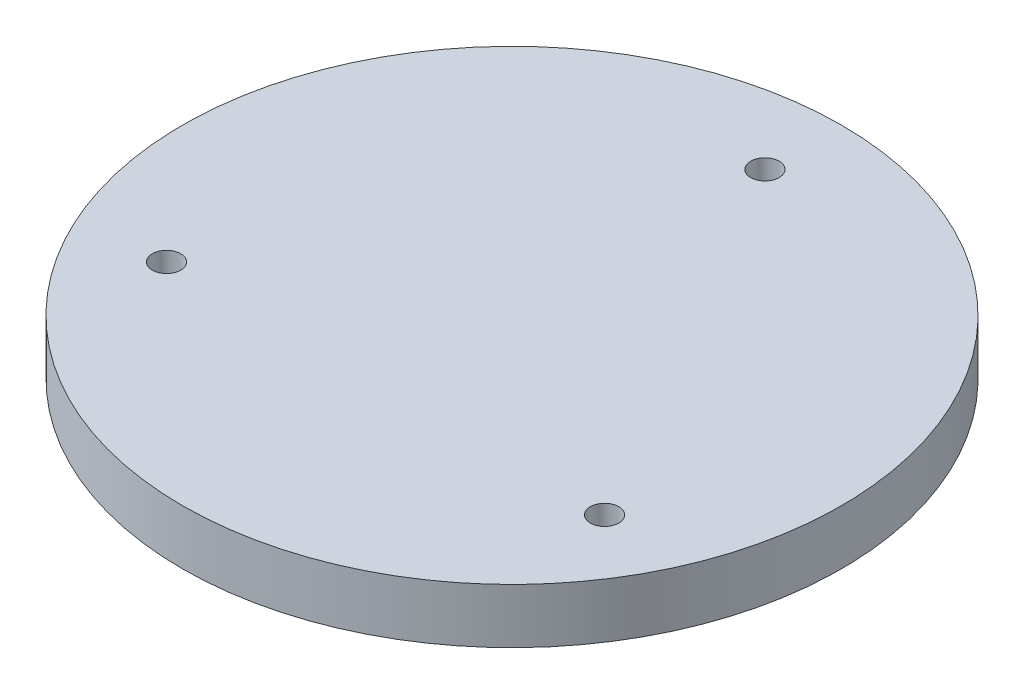
ISO-10303-21;
HEADER;
FILE_DESCRIPTION(('STEP AP214'),'2;1');
FILE_NAME('part.step','',(''),(''),'','','');
FILE_SCHEMA(('AUTOMOTIVE_DESIGN { 1 0 10303 214 1 1 1 1 }'));
ENDSEC;
DATA;
#1=APPLICATION_CONTEXT('core data for automotive mechanical design processes');
#2=APPLICATION_PROTOCOL_DEFINITION('international standard','automotive_design',2000,#1);
#3=PRODUCT_CONTEXT('',#1,'mechanical');
#4=PRODUCT('Part','Part','',(#3));
#5=PRODUCT_RELATED_PRODUCT_CATEGORY('part','',(#4));
#6=PRODUCT_DEFINITION_FORMATION('','',#4);
#7=PRODUCT_DEFINITION_CONTEXT('part definition',#1,'design');
#8=PRODUCT_DEFINITION('design','',#6,#7);
#9=PRODUCT_DEFINITION_SHAPE('','',#8);
#10=(LENGTH_UNIT() NAMED_UNIT(*) SI_UNIT(.MILLI.,.METRE.));
#11=(NAMED_UNIT(*) PLANE_ANGLE_UNIT() SI_UNIT($,.RADIAN.));
#12=(NAMED_UNIT(*) SI_UNIT($,.STERADIAN.) SOLID_ANGLE_UNIT());
#13=UNCERTAINTY_MEASURE_WITH_UNIT(LENGTH_MEASURE(1.E-05),#10,'distance_accuracy_value','');
#14=(GEOMETRIC_REPRESENTATION_CONTEXT(3) GLOBAL_UNCERTAINTY_ASSIGNED_CONTEXT((#13)) GLOBAL_UNIT_ASSIGNED_CONTEXT((#10,
#11,#12)) REPRESENTATION_CONTEXT('',''));
#15=CARTESIAN_POINT('',(0.,0.,0.));
#16=DIRECTION('',(0.,0.,1.));
#17=DIRECTION('',(1.,0.,0.));
#18=AXIS2_PLACEMENT_3D('',#15,#16,#17);
#19=CARTESIAN_POINT('',(0.,6.35,0.));
#20=DIRECTION('',(0.,-1.,0.));
#21=DIRECTION('',(0.,0.,-1.));
#22=AXIS2_PLACEMENT_3D('',#19,#20,#21);
#23=CYLINDRICAL_SURFACE('',#22,38.227);
#24=CARTESIAN_POINT('',(0.,6.35,0.));
#25=DIRECTION('',(0.,1.,0.));
#26=DIRECTION('',(0.,0.,1.));
#27=AXIS2_PLACEMENT_3D('',#24,#25,#26);
#28=CIRCLE('',#27,38.227);
#29=CARTESIAN_POINT('',(0.,6.35,38.227));
#30=VERTEX_POINT('',#29);
#31=EDGE_CURVE('E10',#30,#30,#28,.T.);
#32=ORIENTED_EDGE('',*,*,#31,.F.);
#33=EDGE_LOOP('',(#32));
#34=FACE_BOUND('',#33,.T.);
#35=CARTESIAN_POINT('',(0.,0.,0.));
#36=DIRECTION('',(0.,1.,0.));
#37=DIRECTION('',(0.,0.,1.));
#38=AXIS2_PLACEMENT_3D('',#35,#36,#37);
#39=CIRCLE('',#38,38.227);
#40=CARTESIAN_POINT('',(0.,0.,38.227));
#41=VERTEX_POINT('',#40);
#42=EDGE_CURVE('E36',#41,#41,#39,.T.);
#43=ORIENTED_EDGE('',*,*,#42,.T.);
#44=EDGE_LOOP('',(#43));
#45=FACE_BOUND('',#44,.T.);
#46=ADVANCED_FACE('F33',(#34,#45),#23,.T.);
#47=CARTESIAN_POINT('',(0.,6.35,0.));
#48=DIRECTION('',(0.,1.,0.));
#49=DIRECTION('',(0.,0.,1.));
#50=AXIS2_PLACEMENT_3D('',#47,#48,#49);
#51=PLANE('',#50);
#52=CARTESIAN_POINT('',(0.,6.35,-29.337));
#53=DIRECTION('',(0.,1.,0.));
#54=DIRECTION('',(0.,0.,1.));
#55=AXIS2_PLACEMENT_3D('',#52,#53,#54);
#56=CIRCLE('',#55,1.651);
#57=CARTESIAN_POINT('',(0.,6.35,-27.686));
#58=VERTEX_POINT('',#57);
#59=EDGE_CURVE('E57',#58,#58,#56,.T.);
#60=ORIENTED_EDGE('',*,*,#59,.F.);
#61=EDGE_LOOP('',(#60));
#62=FACE_BOUND('',#61,.T.);
#63=CARTESIAN_POINT('',(25.4065872708259,6.35,14.668499999999));
#64=DIRECTION('',(0.,1.,0.));
#65=DIRECTION('',(0.,0.,1.));
#66=AXIS2_PLACEMENT_3D('',#63,#64,#65);
#67=CIRCLE('',#66,1.651);
#68=CARTESIAN_POINT('',(25.4065872708259,6.35,16.319499999999));
#69=VERTEX_POINT('',#68);
#70=EDGE_CURVE('E51',#69,#69,#67,.T.);
#71=ORIENTED_EDGE('',*,*,#70,.F.);
#72=EDGE_LOOP('',(#71));
#73=FACE_BOUND('',#72,.T.);
#74=CARTESIAN_POINT('',(-25.4065872708223,6.35,14.668500000001));
#75=DIRECTION('',(0.,1.,0.));
#76=DIRECTION('',(0.,0.,1.));
#77=AXIS2_PLACEMENT_3D('',#74,#75,#76);
#78=CIRCLE('',#77,1.651);
#79=CARTESIAN_POINT('',(-25.4065872708223,6.35,16.319500000001));
#80=VERTEX_POINT('',#79);
#81=EDGE_CURVE('E45',#80,#80,#78,.T.);
#82=ORIENTED_EDGE('',*,*,#81,.F.);
#83=EDGE_LOOP('',(#82));
#84=FACE_BOUND('',#83,.T.);
#85=ORIENTED_EDGE('',*,*,#31,.T.);
#86=EDGE_LOOP('',(#85));
#87=FACE_BOUND('',#86,.T.);
#88=ADVANCED_FACE('F73',(#62,#73,#84,#87),#51,.T.);
#89=CARTESIAN_POINT('',(0.,0.,0.));
#90=DIRECTION('',(0.,1.,0.));
#91=DIRECTION('',(0.,0.,1.));
#92=AXIS2_PLACEMENT_3D('',#89,#90,#91);
#93=PLANE('',#92);
#94=CARTESIAN_POINT('',(0.,0.,-29.337));
#95=DIRECTION('',(0.,1.,0.));
#96=DIRECTION('',(0.,0.,1.));
#97=AXIS2_PLACEMENT_3D('',#94,#95,#96);
#98=CIRCLE('',#97,1.651);
#99=CARTESIAN_POINT('',(0.,0.,-27.686));
#100=VERTEX_POINT('',#99);
#101=EDGE_CURVE('E43',#100,#100,#98,.T.);
#102=ORIENTED_EDGE('',*,*,#101,.T.);
#103=EDGE_LOOP('',(#102));
#104=FACE_BOUND('',#103,.T.);
#105=CARTESIAN_POINT('',(25.4065872708259,0.,14.668499999999));
#106=DIRECTION('',(0.,1.,0.));
#107=DIRECTION('',(0.,0.,1.));
#108=AXIS2_PLACEMENT_3D('',#105,#106,#107);
#109=CIRCLE('',#108,1.651);
#110=CARTESIAN_POINT('',(25.4065872708259,0.,16.319499999999));
#111=VERTEX_POINT('',#110);
#112=EDGE_CURVE('E54',#111,#111,#109,.T.);
#113=ORIENTED_EDGE('',*,*,#112,.T.);
#114=EDGE_LOOP('',(#113));
#115=FACE_BOUND('',#114,.T.);
#116=CARTESIAN_POINT('',(-25.4065872708223,0.,14.668500000001));
#117=DIRECTION('',(0.,1.,0.));
#118=DIRECTION('',(0.,0.,1.));
#119=AXIS2_PLACEMENT_3D('',#116,#117,#118);
#120=CIRCLE('',#119,1.651);
#121=CARTESIAN_POINT('',(-25.4065872708223,0.,16.319500000001));
#122=VERTEX_POINT('',#121);
#123=EDGE_CURVE('E48',#122,#122,#120,.T.);
#124=ORIENTED_EDGE('',*,*,#123,.T.);
#125=EDGE_LOOP('',(#124));
#126=FACE_BOUND('',#125,.T.);
#127=ORIENTED_EDGE('',*,*,#42,.F.);
#128=EDGE_LOOP('',(#127));
#129=FACE_BOUND('',#128,.T.);
#130=ADVANCED_FACE('F63',(#104,#115,#126,#129),#93,.F.);
#131=CARTESIAN_POINT('',(-25.4065872708223,0.,14.668500000001));
#132=DIRECTION('',(0.,1.,0.));
#133=DIRECTION('',(0.,0.,1.));
#134=AXIS2_PLACEMENT_3D('',#131,#132,#133);
#135=CYLINDRICAL_SURFACE('',#134,1.651);
#136=ORIENTED_EDGE('',*,*,#123,.F.);
#137=EDGE_LOOP('',(#136));
#138=FACE_BOUND('',#137,.T.);
#139=ORIENTED_EDGE('',*,*,#81,.T.);
#140=EDGE_LOOP('',(#139));
#141=FACE_BOUND('',#140,.T.);
#142=ADVANCED_FACE('F81',(#138,#141),#135,.F.);
#143=CARTESIAN_POINT('',(25.4065872708259,0.,14.668499999999));
#144=DIRECTION('',(0.,1.,0.));
#145=DIRECTION('',(0.,0.,1.));
#146=AXIS2_PLACEMENT_3D('',#143,#144,#145);
#147=CYLINDRICAL_SURFACE('',#146,1.651);
#148=ORIENTED_EDGE('',*,*,#112,.F.);
#149=EDGE_LOOP('',(#148));
#150=FACE_BOUND('',#149,.T.);
#151=ORIENTED_EDGE('',*,*,#70,.T.);
#152=EDGE_LOOP('',(#151));
#153=FACE_BOUND('',#152,.T.);
#154=ADVANCED_FACE('F69',(#150,#153),#147,.F.);
#155=CARTESIAN_POINT('',(0.,0.,-29.337));
#156=DIRECTION('',(0.,1.,0.));
#157=DIRECTION('',(0.,0.,1.));
#158=AXIS2_PLACEMENT_3D('',#155,#156,#157);
#159=CYLINDRICAL_SURFACE('',#158,1.651);
#160=ORIENTED_EDGE('',*,*,#101,.F.);
#161=EDGE_LOOP('',(#160));
#162=FACE_BOUND('',#161,.T.);
#163=ORIENTED_EDGE('',*,*,#59,.T.);
#164=EDGE_LOOP('',(#163));
#165=FACE_BOUND('',#164,.T.);
#166=ADVANCED_FACE('F66',(#162,#165),#159,.F.);
#167=CLOSED_SHELL('',(#46,#88,#130,#142,#154,#166));
#168=MANIFOLD_SOLID_BREP('B2',#167);
#169=ADVANCED_BREP_SHAPE_REPRESENTATION('',(#18,#168),#14);
#170=SHAPE_DEFINITION_REPRESENTATION(#9,#169);
ENDSEC;
END-ISO-10303-21;
